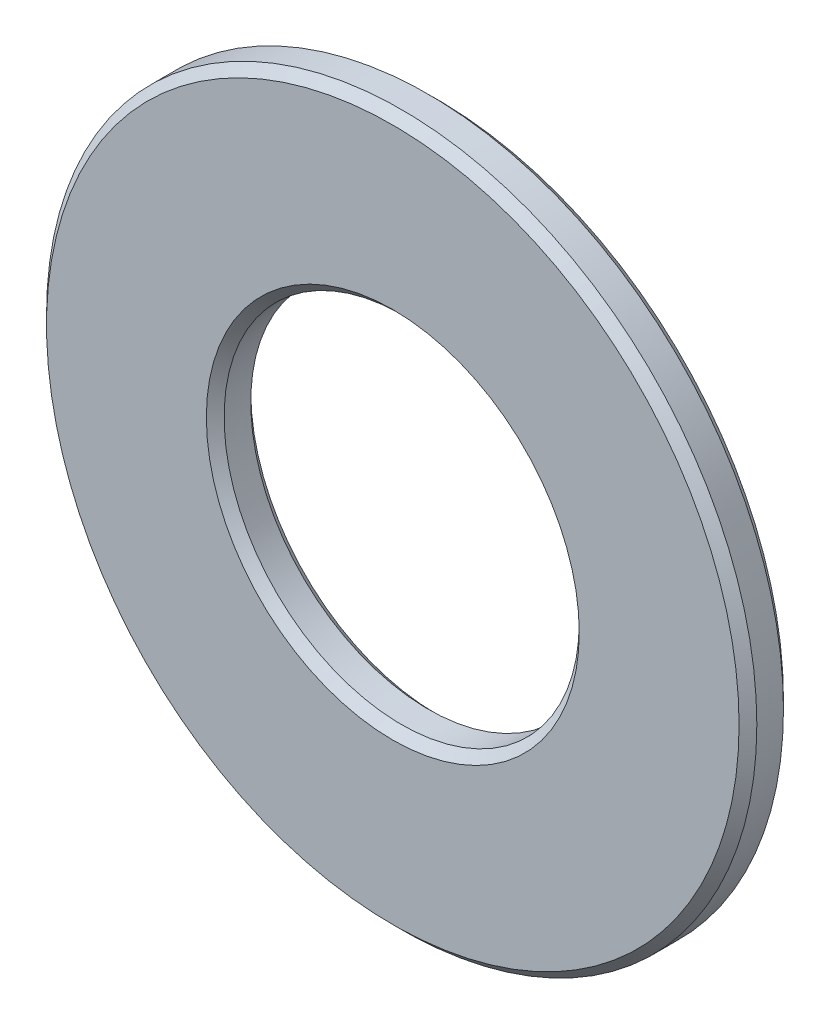
ISO-10303-21;
HEADER;
FILE_DESCRIPTION(('STEP AP214'),'2;1');
FILE_NAME('part.step','',(''),(''),'','','');
FILE_SCHEMA(('AUTOMOTIVE_DESIGN { 1 0 10303 214 1 1 1 1 }'));
ENDSEC;
DATA;
#1=APPLICATION_CONTEXT('core data for automotive mechanical design processes');
#2=APPLICATION_PROTOCOL_DEFINITION('international standard','automotive_design',2000,#1);
#3=PRODUCT_CONTEXT('',#1,'mechanical');
#4=PRODUCT('Part','Part','',(#3));
#5=PRODUCT_RELATED_PRODUCT_CATEGORY('part','',(#4));
#6=PRODUCT_DEFINITION_FORMATION('','',#4);
#7=PRODUCT_DEFINITION_CONTEXT('part definition',#1,'design');
#8=PRODUCT_DEFINITION('design','',#6,#7);
#9=PRODUCT_DEFINITION_SHAPE('','',#8);
#10=(LENGTH_UNIT() NAMED_UNIT(*) SI_UNIT(.MILLI.,.METRE.));
#11=(NAMED_UNIT(*) PLANE_ANGLE_UNIT() SI_UNIT($,.RADIAN.));
#12=(NAMED_UNIT(*) SI_UNIT($,.STERADIAN.) SOLID_ANGLE_UNIT());
#13=UNCERTAINTY_MEASURE_WITH_UNIT(LENGTH_MEASURE(1.E-05),#10,'distance_accuracy_value','');
#14=(GEOMETRIC_REPRESENTATION_CONTEXT(3) GLOBAL_UNCERTAINTY_ASSIGNED_CONTEXT((#13)) GLOBAL_UNIT_ASSIGNED_CONTEXT((#10,
#11,#12)) REPRESENTATION_CONTEXT('',''));
#15=CARTESIAN_POINT('',(0.,0.,0.));
#16=DIRECTION('',(0.,0.,1.));
#17=DIRECTION('',(1.,0.,0.));
#18=AXIS2_PLACEMENT_3D('',#15,#16,#17);
#19=CARTESIAN_POINT('',(0.,0.,0.5));
#20=DIRECTION('',(0.,0.,1.));
#21=DIRECTION('',(1.,0.,0.));
#22=AXIS2_PLACEMENT_3D('',#19,#20,#21);
#23=PLANE('',#22);
#24=CARTESIAN_POINT('',(0.,0.,0.5));
#25=DIRECTION('',(0.,0.,1.));
#26=DIRECTION('',(1.,0.,0.));
#27=AXIS2_PLACEMENT_3D('',#24,#25,#26);
#28=CIRCLE('',#27,2.1);
#29=CARTESIAN_POINT('',(2.1,0.,0.5));
#30=VERTEX_POINT('',#29);
#31=EDGE_CURVE('E10',#30,#30,#28,.F.);
#32=ORIENTED_EDGE('',*,*,#31,.T.);
#33=EDGE_LOOP('',(#32));
#34=FACE_BOUND('',#33,.T.);
#35=CARTESIAN_POINT('',(0.,0.,0.5));
#36=DIRECTION('',(0.,0.,1.));
#37=DIRECTION('',(1.,0.,0.));
#38=AXIS2_PLACEMENT_3D('',#35,#36,#37);
#39=CIRCLE('',#38,3.9);
#40=CARTESIAN_POINT('',(3.9,0.,0.5));
#41=VERTEX_POINT('',#40);
#42=EDGE_CURVE('E39',#41,#41,#39,.T.);
#43=ORIENTED_EDGE('',*,*,#42,.T.);
#44=EDGE_LOOP('',(#43));
#45=FACE_BOUND('',#44,.T.);
#46=ADVANCED_FACE('F32',(#34,#45),#23,.T.);
#47=CARTESIAN_POINT('',(0.,0.,0.));
#48=DIRECTION('',(0.,0.,1.));
#49=DIRECTION('',(1.,0.,0.));
#50=AXIS2_PLACEMENT_3D('',#47,#48,#49);
#51=PLANE('',#50);
#52=CARTESIAN_POINT('',(0.,0.,0.));
#53=DIRECTION('',(0.,0.,1.));
#54=DIRECTION('',(1.,0.,0.));
#55=AXIS2_PLACEMENT_3D('',#52,#53,#54);
#56=CIRCLE('',#55,2.1);
#57=CARTESIAN_POINT('',(2.1,0.,0.));
#58=VERTEX_POINT('',#57);
#59=EDGE_CURVE('E58',#58,#58,#56,.T.);
#60=ORIENTED_EDGE('',*,*,#59,.T.);
#61=EDGE_LOOP('',(#60));
#62=FACE_BOUND('',#61,.T.);
#63=CARTESIAN_POINT('',(0.,0.,0.));
#64=DIRECTION('',(0.,0.,1.));
#65=DIRECTION('',(1.,0.,0.));
#66=AXIS2_PLACEMENT_3D('',#63,#64,#65);
#67=CIRCLE('',#66,3.9);
#68=CARTESIAN_POINT('',(3.9,0.,0.));
#69=VERTEX_POINT('',#68);
#70=EDGE_CURVE('E61',#69,#69,#67,.F.);
#71=ORIENTED_EDGE('',*,*,#70,.T.);
#72=EDGE_LOOP('',(#71));
#73=FACE_BOUND('',#72,.T.);
#74=ADVANCED_FACE('F65',(#62,#73),#51,.F.);
#75=CARTESIAN_POINT('',(0.,0.,0.5));
#76=DIRECTION('',(0.,0.,-1.));
#77=DIRECTION('',(-1.,0.,0.));
#78=AXIS2_PLACEMENT_3D('',#75,#76,#77);
#79=CYLINDRICAL_SURFACE('',#78,4.);
#80=CARTESIAN_POINT('',(0.,0.,0.0999999999999994));
#81=DIRECTION('',(0.,0.,1.));
#82=DIRECTION('',(1.,0.,0.));
#83=AXIS2_PLACEMENT_3D('',#80,#81,#82);
#84=CIRCLE('',#83,4.);
#85=CARTESIAN_POINT('',(4.,0.,0.0999999999999994));
#86=VERTEX_POINT('',#85);
#87=EDGE_CURVE('E43',#86,#86,#84,.T.);
#88=ORIENTED_EDGE('',*,*,#87,.T.);
#89=EDGE_LOOP('',(#88));
#90=FACE_BOUND('',#89,.T.);
#91=CARTESIAN_POINT('',(0.,0.,0.400000000000002));
#92=DIRECTION('',(0.,0.,1.));
#93=DIRECTION('',(1.,0.,0.));
#94=AXIS2_PLACEMENT_3D('',#91,#92,#93);
#95=CIRCLE('',#94,4.);
#96=CARTESIAN_POINT('',(4.,0.,0.400000000000002));
#97=VERTEX_POINT('',#96);
#98=EDGE_CURVE('E47',#97,#97,#95,.F.);
#99=ORIENTED_EDGE('',*,*,#98,.T.);
#100=EDGE_LOOP('',(#99));
#101=FACE_BOUND('',#100,.T.);
#102=ADVANCED_FACE('F75',(#90,#101),#79,.T.);
#103=CARTESIAN_POINT('',(0.,0.,0.5));
#104=DIRECTION('',(0.,0.,-1.));
#105=DIRECTION('',(-1.,0.,0.));
#106=AXIS2_PLACEMENT_3D('',#103,#104,#105);
#107=CYLINDRICAL_SURFACE('',#106,2.);
#108=CARTESIAN_POINT('',(0.,0.,0.0999999999999994));
#109=DIRECTION('',(0.,0.,1.));
#110=DIRECTION('',(1.,0.,0.));
#111=AXIS2_PLACEMENT_3D('',#108,#109,#110);
#112=CIRCLE('',#111,2.);
#113=CARTESIAN_POINT('',(2.,0.,0.0999999999999994));
#114=VERTEX_POINT('',#113);
#115=EDGE_CURVE('E52',#114,#114,#112,.F.);
#116=ORIENTED_EDGE('',*,*,#115,.T.);
#117=EDGE_LOOP('',(#116));
#118=FACE_BOUND('',#117,.T.);
#119=CARTESIAN_POINT('',(0.,0.,0.400000000000003));
#120=DIRECTION('',(0.,0.,1.));
#121=DIRECTION('',(1.,0.,0.));
#122=AXIS2_PLACEMENT_3D('',#119,#120,#121);
#123=CIRCLE('',#122,2.);
#124=CARTESIAN_POINT('',(2.,0.,0.400000000000003));
#125=VERTEX_POINT('',#124);
#126=EDGE_CURVE('E55',#125,#125,#123,.T.);
#127=ORIENTED_EDGE('',*,*,#126,.T.);
#128=EDGE_LOOP('',(#127));
#129=FACE_BOUND('',#128,.T.);
#130=ADVANCED_FACE('F78',(#118,#129),#107,.F.);
#131=CARTESIAN_POINT('',(0.,0.,0.));
#132=DIRECTION('',(0.,0.,-1.));
#133=DIRECTION('',(-1.,0.,0.));
#134=AXIS2_PLACEMENT_3D('',#131,#132,#133);
#135=CONICAL_SURFACE('',#134,2.1,0.785398163397444);
#136=ORIENTED_EDGE('',*,*,#115,.F.);
#137=EDGE_LOOP('',(#136));
#138=FACE_BOUND('',#137,.T.);
#139=ORIENTED_EDGE('',*,*,#59,.F.);
#140=EDGE_LOOP('',(#139));
#141=FACE_BOUND('',#140,.T.);
#142=ADVANCED_FACE('F71',(#138,#141),#135,.F.);
#143=CARTESIAN_POINT('',(0.,0.,0.0999999999999994));
#144=DIRECTION('',(0.,0.,1.));
#145=DIRECTION('',(1.,0.,0.));
#146=AXIS2_PLACEMENT_3D('',#143,#144,#145);
#147=CONICAL_SURFACE('',#146,4.,0.785398163397448);
#148=ORIENTED_EDGE('',*,*,#70,.F.);
#149=EDGE_LOOP('',(#148));
#150=FACE_BOUND('',#149,.T.);
#151=ORIENTED_EDGE('',*,*,#87,.F.);
#152=EDGE_LOOP('',(#151));
#153=FACE_BOUND('',#152,.T.);
#154=ADVANCED_FACE('F67',(#150,#153),#147,.T.);
#155=CARTESIAN_POINT('',(0.,0.,0.400000000000003));
#156=DIRECTION('',(0.,0.,1.));
#157=DIRECTION('',(1.,0.,0.));
#158=AXIS2_PLACEMENT_3D('',#155,#156,#157);
#159=CONICAL_SURFACE('',#158,2.,0.785398163397453);
#160=ORIENTED_EDGE('',*,*,#31,.F.);
#161=EDGE_LOOP('',(#160));
#162=FACE_BOUND('',#161,.T.);
#163=ORIENTED_EDGE('',*,*,#126,.F.);
#164=EDGE_LOOP('',(#163));
#165=FACE_BOUND('',#164,.T.);
#166=ADVANCED_FACE('F70',(#162,#165),#159,.F.);
#167=CARTESIAN_POINT('',(0.,0.,0.5));
#168=DIRECTION('',(0.,0.,-1.));
#169=DIRECTION('',(-1.,0.,0.));
#170=AXIS2_PLACEMENT_3D('',#167,#168,#169);
#171=CONICAL_SURFACE('',#170,3.9,0.785398163397448);
#172=ORIENTED_EDGE('',*,*,#98,.F.);
#173=EDGE_LOOP('',(#172));
#174=FACE_BOUND('',#173,.T.);
#175=ORIENTED_EDGE('',*,*,#42,.F.);
#176=EDGE_LOOP('',(#175));
#177=FACE_BOUND('',#176,.T.);
#178=ADVANCED_FACE('F34',(#174,#177),#171,.T.);
#179=CLOSED_SHELL('',(#46,#74,#102,#130,#142,#154,#166,#178));
#180=MANIFOLD_SOLID_BREP('B2',#179);
#181=ADVANCED_BREP_SHAPE_REPRESENTATION('',(#18,#180),#14);
#182=SHAPE_DEFINITION_REPRESENTATION(#9,#181);
ENDSEC;
END-ISO-10303-21;
